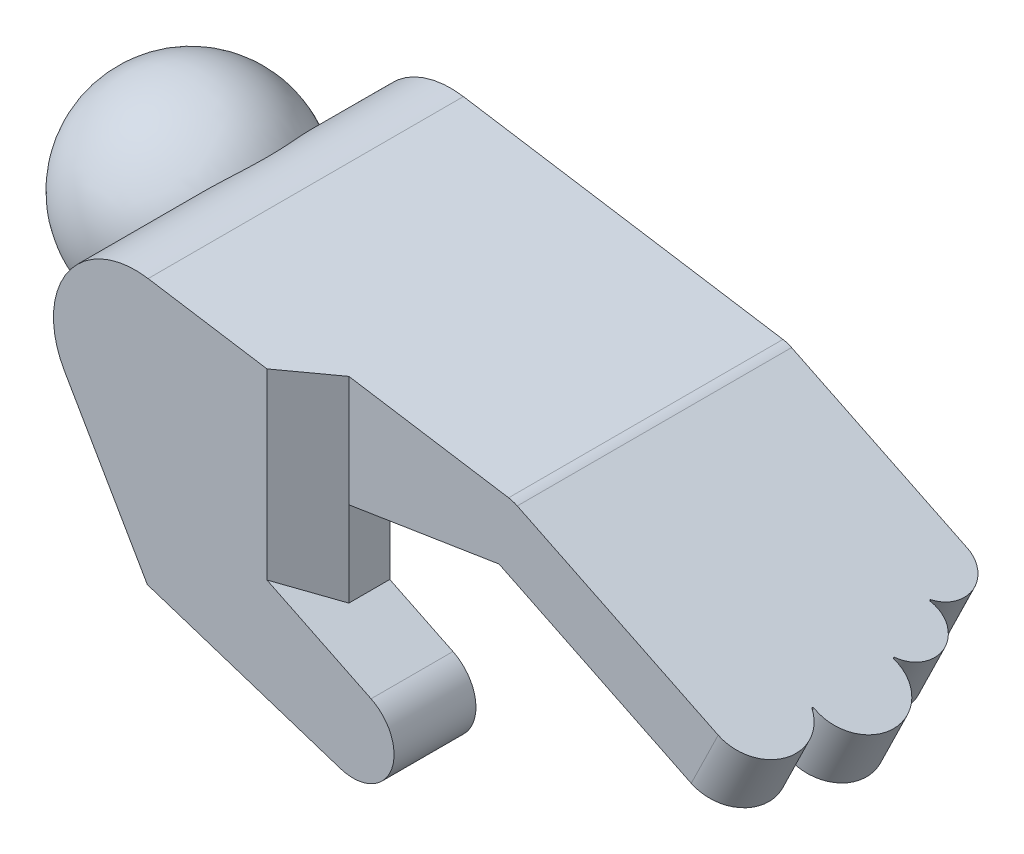
ISO-10303-21;
HEADER;
FILE_DESCRIPTION(('STEP AP214'),'2;1');
FILE_NAME('part.step','',(''),(''),'','','');
FILE_SCHEMA(('AUTOMOTIVE_DESIGN { 1 0 10303 214 1 1 1 1 }'));
ENDSEC;
DATA;
#1=APPLICATION_CONTEXT('core data for automotive mechanical design processes');
#2=APPLICATION_PROTOCOL_DEFINITION('international standard','automotive_design',2000,#1);
#3=PRODUCT_CONTEXT('',#1,'mechanical');
#4=PRODUCT('Part','Part','',(#3));
#5=PRODUCT_RELATED_PRODUCT_CATEGORY('part','',(#4));
#6=PRODUCT_DEFINITION_FORMATION('','',#4);
#7=PRODUCT_DEFINITION_CONTEXT('part definition',#1,'design');
#8=PRODUCT_DEFINITION('design','',#6,#7);
#9=PRODUCT_DEFINITION_SHAPE('','',#8);
#10=(LENGTH_UNIT() NAMED_UNIT(*) SI_UNIT(.MILLI.,.METRE.));
#11=(NAMED_UNIT(*) PLANE_ANGLE_UNIT() SI_UNIT($,.RADIAN.));
#12=(NAMED_UNIT(*) SI_UNIT($,.STERADIAN.) SOLID_ANGLE_UNIT());
#13=UNCERTAINTY_MEASURE_WITH_UNIT(LENGTH_MEASURE(1.E-05),#10,'distance_accuracy_value','');
#14=(GEOMETRIC_REPRESENTATION_CONTEXT(3) GLOBAL_UNCERTAINTY_ASSIGNED_CONTEXT((#13)) GLOBAL_UNIT_ASSIGNED_CONTEXT((#10,
#11,#12)) REPRESENTATION_CONTEXT('',''));
#15=CARTESIAN_POINT('',(0.,0.,0.));
#16=DIRECTION('',(0.,0.,1.));
#17=DIRECTION('',(1.,0.,0.));
#18=AXIS2_PLACEMENT_3D('',#15,#16,#17);
#19=CARTESIAN_POINT('',(0.,0.,313.765538695854));
#20=DIRECTION('',(0.,0.,1.));
#21=DIRECTION('',(-1.,0.,0.));
#22=AXIS2_PLACEMENT_3D('',#19,#20,#21);
#23=CYLINDRICAL_SURFACE('',#22,25.4);
#24=CARTESIAN_POINT('',(-14.2875000000001,21.0006510315752,356.310538695854));
#25=CARTESIAN_POINT('',(-14.2874986942664,21.0006504840851,355.865316795389));
#26=CARTESIAN_POINT('',(-14.2953081922358,20.9953449296755,355.420112334765));
#27=CARTESIAN_POINT('',(-14.3264868198177,20.9740826371853,354.530467006661));
#28=CARTESIAN_POINT('',(-14.3498569674292,20.9581252022439,354.086026191047));
#29=CARTESIAN_POINT('',(-14.4120006937446,20.9154409688301,353.198656579094));
#30=CARTESIAN_POINT('',(-14.4507770141651,20.8887122534647,352.755728066047));
#31=CARTESIAN_POINT('',(-14.5434469305168,20.8242950444131,351.872244221875));
#32=CARTESIAN_POINT('',(-14.5973419405578,20.7866055255082,351.431689116675));
#33=CARTESIAN_POINT('',(-14.7813505313174,20.6565920938604,350.113490462707));
#34=CARTESIAN_POINT('',(-14.9337070642989,20.5473762862208,349.240445202628));
#35=CARTESIAN_POINT('',(-15.2933299297853,20.2811215383024,347.513356495106));
#36=CARTESIAN_POINT('',(-15.5005922793713,20.1240860667829,346.659311674222));
#37=CARTESIAN_POINT('',(-15.9644327536828,19.7581430548752,344.975107681859));
#38=CARTESIAN_POINT('',(-16.2210585055283,19.5491853612722,344.144972475631));
#39=CARTESIAN_POINT('',(-16.7762879292823,19.0748373220827,342.515257533565));
#40=CARTESIAN_POINT('',(-17.074896817441,18.8094399619717,341.715681610329));
#41=CARTESIAN_POINT('',(-17.7050993456686,18.2174673783565,340.154112624149));
#42=CARTESIAN_POINT('',(-18.0366554205532,17.8909614615965,339.392078208027));
#43=CARTESIAN_POINT('',(-18.72301395747,17.1713645796119,337.911247083232));
#44=CARTESIAN_POINT('',(-19.0778074919359,16.77829909486,337.192433970652));
#45=CARTESIAN_POINT('',(-19.698074177451,16.0408372382136,335.999570313704));
#46=CARTESIAN_POINT('',(-19.9607294175346,15.7136483536111,335.513358231345));
#47=CARTESIAN_POINT('',(-20.4873489903724,15.020582613139,334.570004724919));
#48=CARTESIAN_POINT('',(-20.751313205354,14.65470917974,334.112860734883));
#49=CARTESIAN_POINT('',(-21.2749618655439,13.8835494219702,333.231574544818));
#50=CARTESIAN_POINT('',(-21.5346511969972,13.4783123676138,332.807392255531));
#51=CARTESIAN_POINT('',(-22.0443412853831,12.627461213939,331.995190238018));
#52=CARTESIAN_POINT('',(-22.2943438885055,12.1818548631691,331.607163598898));
#53=CARTESIAN_POINT('',(-22.7308063467687,11.3423138017661,330.943881737589));
#54=CARTESIAN_POINT('',(-22.9200834161575,10.9554874876247,330.661467586093));
#55=CARTESIAN_POINT('',(-23.2850711723188,10.1566817400668,330.124915253476));
#56=CARTESIAN_POINT('',(-23.4607847356159,9.74470767331466,329.870771071838));
#57=CARTESIAN_POINT('',(-23.7952610731408,8.89680874924634,329.393100796652));
#58=CARTESIAN_POINT('',(-23.9540252529344,8.46088588248606,329.169572163806));
#59=CARTESIAN_POINT('',(-24.2512534757125,7.56693688587108,328.75548637586));
#60=CARTESIAN_POINT('',(-24.3897171928589,7.10891040139303,328.564929749978));
#61=CARTESIAN_POINT('',(-24.6441297571777,6.16971403368265,328.217735436704));
#62=CARTESIAN_POINT('',(-24.7598936666471,5.68839091703919,328.06137525246));
#63=CARTESIAN_POINT('',(-24.964603377329,4.70941624230395,327.786615649843));
#64=CARTESIAN_POINT('',(-25.0535487892989,4.21176444733459,327.668216782437));
#65=CARTESIAN_POINT('',(-25.202164653844,3.20465425990389,327.471205024985));
#66=CARTESIAN_POINT('',(-25.2618533468752,2.69520343173523,327.392567344378));
#67=CARTESIAN_POINT('',(-25.3503347241816,1.66901685292015,327.276223965057));
#68=CARTESIAN_POINT('',(-25.3791317155348,1.15228212801267,327.238512560185));
#69=CARTESIAN_POINT('',(-25.4033365174727,0.183902258199855,327.206812286342));
#70=CARTESIAN_POINT('',(-25.4025903098686,-0.267492897680755,327.207787210874));
#71=CARTESIAN_POINT('',(-25.3771121944251,-1.16840876612933,327.241160585455));
#72=CARTESIAN_POINT('',(-25.3523827477915,-1.61792966628314,327.273555811093));
#73=CARTESIAN_POINT('',(-25.279490574644,-2.51164704994887,327.369357636389));
#74=CARTESIAN_POINT('',(-25.2313313649835,-2.95584432229798,327.432759581885));
#75=CARTESIAN_POINT('',(-25.1126199815714,-3.83580958646496,327.58980927665));
#76=CARTESIAN_POINT('',(-25.0420673950719,-4.2715774227569,327.683457583412));
#77=CARTESIAN_POINT('',(-24.8822465753655,-5.12006857663343,327.896972379774));
#78=CARTESIAN_POINT('',(-24.7935407591993,-5.53309627168716,328.016054848127));
#79=CARTESIAN_POINT('',(-24.5979903249191,-6.34615695257178,328.280610986714));
#80=CARTESIAN_POINT('',(-24.4911463087951,-6.74619036914593,328.42608378109));
#81=CARTESIAN_POINT('',(-24.2611922024166,-7.53139660098538,328.742073136512));
#82=CARTESIAN_POINT('',(-24.1380815889216,-7.91656893770576,328.912590503176));
#83=CARTESIAN_POINT('',(-23.8776053229466,-8.67058905862418,329.277239563222));
#84=CARTESIAN_POINT('',(-23.7402378123341,-9.03943470597027,329.47137433528));
#85=CARTESIAN_POINT('',(-23.4382445568037,-9.79756248541901,329.903377581798));
#86=CARTESIAN_POINT('',(-23.2722715653822,-10.1849101485111,330.143698463196));
#87=CARTESIAN_POINT('',(-22.9283245879777,-10.9372326187328,330.649385973208));
#88=CARTESIAN_POINT('',(-22.7503501265942,-11.3022065385024,330.914753594137));
#89=CARTESIAN_POINT('',(-22.3850891575176,-12.009424049734,331.468778603957));
#90=CARTESIAN_POINT('',(-22.1977975852448,-12.3516550372519,331.757448713851));
#91=CARTESIAN_POINT('',(-21.8166665848664,-13.0130240232139,332.356161834644));
#92=CARTESIAN_POINT('',(-21.6228259741793,-13.3321578178764,332.66620871625));
#93=CARTESIAN_POINT('',(-21.1336062810805,-14.1006775780671,333.465348345097));
#94=CARTESIAN_POINT('',(-20.8357310304868,-14.5357893412474,333.966717682813));
#95=CARTESIAN_POINT('',(-20.2390038816648,-15.3557839209573,335.008516828909));
#96=CARTESIAN_POINT('',(-19.9401516449805,-15.7406468866985,335.548961943962));
#97=CARTESIAN_POINT('',(-19.3483285713351,-16.4626964595997,336.665007342711));
#98=CARTESIAN_POINT('',(-19.0553662922109,-16.7998174686624,337.240654469912));
#99=CARTESIAN_POINT('',(-18.4822534895632,-17.428344928899,338.422294522743));
#100=CARTESIAN_POINT('',(-18.2021018325466,-17.7197554301378,339.028284753615));
#101=CARTESIAN_POINT('',(-17.655538560178,-18.2645421536684,340.278013398218));
#102=CARTESIAN_POINT('',(-17.3894597033053,-18.5171502143908,340.922231333266));
#103=CARTESIAN_POINT('',(-16.8819412450539,-18.9809974338255,342.234774640221));
#104=CARTESIAN_POINT('',(-16.6405018685819,-19.1922362149396,342.903100232105));
#105=CARTESIAN_POINT('',(-16.1870864732721,-19.5761715888971,344.260277668861));
#106=CARTESIAN_POINT('',(-15.9751029506536,-19.748878004547,344.949124231582));
#107=CARTESIAN_POINT('',(-15.5846354049784,-20.0584443736291,346.344174901933));
#108=CARTESIAN_POINT('',(-15.4061540631932,-20.1953014582874,347.050380393735));
#109=CARTESIAN_POINT('',(-15.0571409775409,-20.4572391343229,348.606241057494));
#110=CARTESIAN_POINT('',(-14.893927079856,-20.5756777838909,349.458675460193));
#111=CARTESIAN_POINT('',(-14.623601226045,-20.7686751885555,351.177356506154));
#112=CARTESIAN_POINT('',(-14.5164949153441,-20.8432295282001,352.043604530281));
#113=CARTESIAN_POINT('',(-14.3613252214602,-20.9504482731531,353.784109273622));
#114=CARTESIAN_POINT('',(-14.313271671088,-20.9831057022924,354.658367302163));
#115=CARTESIAN_POINT('',(-14.2775752024917,-21.0074107874627,356.408662553159));
#116=CARTESIAN_POINT('',(-14.2899310179491,-20.9990593031344,357.284699737934));
#117=CARTESIAN_POINT('',(-14.3753479695872,-20.9406805821822,359.045648368404));
#118=CARTESIAN_POINT('',(-14.449319483423,-20.8900283183938,359.930495074302));
#119=CARTESIAN_POINT('',(-14.6570509388758,-20.7448032633027,361.689518496986));
#120=CARTESIAN_POINT('',(-14.7908128513621,-20.6502290241973,362.563694861069));
#121=CARTESIAN_POINT('',(-15.1144931659491,-20.4145085488666,364.296014406867));
#122=CARTESIAN_POINT('',(-15.3044607078546,-20.2733215471804,365.154142857186));
#123=CARTESIAN_POINT('',(-15.7351836903612,-19.9408609717466,366.847641600645));
#124=CARTESIAN_POINT('',(-15.9759382526866,-19.7495882641329,367.683012287059));
#125=CARTESIAN_POINT('',(-16.5029832525491,-19.3113853670171,369.329819021072));
#126=CARTESIAN_POINT('',(-16.7895217254826,-19.0641487636749,370.141094383013));
#127=CARTESIAN_POINT('',(-17.3989974589035,-18.5095808350739,371.728920148909));
#128=CARTESIAN_POINT('',(-17.7219398091186,-18.2022411022038,372.505465675937));
#129=CARTESIAN_POINT('',(-18.3940944779415,-17.5227091131552,374.01625516464));
#130=CARTESIAN_POINT('',(-18.7432676229845,-17.1506125133526,374.750559424045));
#131=CARTESIAN_POINT('',(-19.457196742374,-16.3361687985509,376.170919657132));
#132=CARTESIAN_POINT('',(-19.8219449912997,-15.8938562222403,376.856999114067));
#133=CARTESIAN_POINT('',(-20.436376464989,-15.0891288542456,377.961029719017));
#134=CARTESIAN_POINT('',(-20.6852896043994,-14.7468519300986,378.394179145816));
#135=CARTESIAN_POINT('',(-21.1800880698568,-14.0269234948975,379.231937492493));
#136=CARTESIAN_POINT('',(-21.4259737436976,-13.649276090907,379.636549716442));
#137=CARTESIAN_POINT('',(-21.9096759813927,-12.8584862291662,380.413664481274));
#138=CARTESIAN_POINT('',(-22.1475016927434,-12.4453860275078,380.786204216408));
#139=CARTESIAN_POINT('',(-22.6102745449212,-11.5833772847153,381.496277692584));
#140=CARTESIAN_POINT('',(-22.8352237511424,-11.1344745141227,381.833817054781));
#141=CARTESIAN_POINT('',(-23.2283719835899,-10.2849914243429,382.413466745548));
#142=CARTESIAN_POINT('',(-23.3995385318585,-9.89006479986961,382.661861713311));
#143=CARTESIAN_POINT('',(-23.7264812663222,-9.07775684684525,383.130405408156));
#144=CARTESIAN_POINT('',(-23.8822605045342,-8.66037999668382,383.350559739262));
#145=CARTESIAN_POINT('',(-24.1753982658378,-7.80477817202381,383.760491010836));
#146=CARTESIAN_POINT('',(-24.3127591392672,-7.36655586726713,383.950271827818));
#147=CARTESIAN_POINT('',(-24.5661721357114,-6.4714381136612,384.297410047068));
#148=CARTESIAN_POINT('',(-24.6822239483945,-6.01454239298258,384.454766977138));
#149=CARTESIAN_POINT('',(-24.891045116151,-5.08189863963257,384.736056805149));
#150=CARTESIAN_POINT('',(-24.9836555781958,-4.6060459944122,384.85976200166));
#151=CARTESIAN_POINT('',(-25.1422934569433,-3.64193759713006,385.070691874088));
#152=CARTESIAN_POINT('',(-25.208320586449,-3.15368171112862,385.15791615588));
#153=CARTESIAN_POINT('',(-25.3120469887455,-2.16914273854084,385.294588837504));
#154=CARTESIAN_POINT('',(-25.3497587696533,-1.67286329539577,385.344053917373));
#155=CARTESIAN_POINT('',(-25.395880116372,-0.676633260395488,385.404515819456));
#156=CARTESIAN_POINT('',(-25.4042927659408,-0.17668306044138,385.415516690059));
#157=CARTESIAN_POINT('',(-25.3923157033826,0.766304832102038,385.399831436847));
#158=CARTESIAN_POINT('',(-25.3750400497521,1.20945816685981,385.377220046905));
#159=CARTESIAN_POINT('',(-25.3175888579372,2.0916589826863,385.301816709053));
#160=CARTESIAN_POINT('',(-25.2774153583744,2.53070682573526,385.249027447912));
#161=CARTESIAN_POINT('',(-25.175019659029,3.4015609371651,385.113898690222));
#162=CARTESIAN_POINT('',(-25.1127994210798,3.83336784630241,385.031561822964));
#163=CARTESIAN_POINT('',(-24.9675772230404,4.68695346128789,384.83826577854));
#164=CARTESIAN_POINT('',(-24.8845746263919,5.10873185953196,384.72730572465));
#165=CARTESIAN_POINT('',(-24.6995938082607,5.93890324025257,384.478197700843));
#166=CARTESIAN_POINT('',(-24.5976546363742,6.347321770019,384.340105647313));
#167=CARTESIAN_POINT('',(-24.376557721504,7.14958616940361,384.037944073852));
#168=CARTESIAN_POINT('',(-24.2574002237255,7.5434322464469,383.873874923856));
#169=CARTESIAN_POINT('',(-24.0038934966984,8.31492606818439,383.521203261934));
#170=CARTESIAN_POINT('',(-23.8695429343697,8.69257238745234,383.332598596978));
#171=CARTESIAN_POINT('',(-23.5877809959132,9.43040764869779,382.932361642552));
#172=CARTESIAN_POINT('',(-23.4403678470097,9.79059421084866,382.720726226595));
#173=CARTESIAN_POINT('',(-23.1157715918167,10.5359429477581,382.24847816587));
#174=CARTESIAN_POINT('',(-22.937160267212,10.9186960590394,381.985044744265));
#175=CARTESIAN_POINT('',(-22.5692452788229,11.6602112282317,381.433140884211));
#176=CARTESIAN_POINT('',(-22.3799410682891,12.0189720573157,381.144669165095));
#177=CARTESIAN_POINT('',(-21.9934803227064,12.7123739254043,380.544518237521));
#178=CARTESIAN_POINT('',(-21.7963195853909,13.0470017799465,380.232826529605));
#179=CARTESIAN_POINT('',(-21.3970326149972,13.6920020480467,379.588217762124));
#180=CARTESIAN_POINT('',(-21.1949054876361,14.0023700505087,379.255296862409));
#181=CARTESIAN_POINT('',(-20.6843714396607,14.7517642406281,378.394685829813));
#182=CARTESIAN_POINT('',(-20.3744622422452,15.1754402942078,377.854440510162));
#183=CARTESIAN_POINT('',(-19.7577641712185,15.9700955542904,376.734735546271));
#184=CARTESIAN_POINT('',(-19.4509766028516,16.3410534957322,376.155260216067));
#185=CARTESIAN_POINT('',(-18.8476413750872,17.0334256985636,374.961003635132));
#186=CARTESIAN_POINT('',(-18.551110662881,17.3547607446052,374.346168040867));
#187=CARTESIAN_POINT('',(-17.9755771371756,17.9502116863526,373.086361787599));
#188=CARTESIAN_POINT('',(-17.6965724887381,18.2243325305282,372.441394295705));
#189=CARTESIAN_POINT('',(-17.1574124395316,18.7329370633162,371.113765122468));
#190=CARTESIAN_POINT('',(-16.8976653476613,18.9666552048906,370.430645059642));
#191=CARTESIAN_POINT('',(-16.4079806079214,19.3918373031753,369.040952692818));
#192=CARTESIAN_POINT('',(-16.1780448431024,19.5832985912416,368.334378910889));
#193=CARTESIAN_POINT('',(-15.7530639248419,19.9267544702823,366.90242258853));
#194=CARTESIAN_POINT('',(-15.5579771222208,20.0787962723092,366.177063702696));
#195=CARTESIAN_POINT('',(-15.2064216883631,20.3463415235515,364.71049607774));
#196=CARTESIAN_POINT('',(-15.0499477829224,20.4618499635316,363.969289518324));
#197=CARTESIAN_POINT('',(-14.8116059079041,20.6347355531499,362.655473703952));
#198=CARTESIAN_POINT('',(-14.7208466792511,20.6994150797694,362.085408257238));
#199=CARTESIAN_POINT('',(-14.5644656215408,20.809746359997,360.940071793075));
#200=CARTESIAN_POINT('',(-14.4988402141455,20.8554008223124,360.36480152859));
#201=CARTESIAN_POINT('',(-14.3935012062784,20.9282396035887,359.210614976644));
#202=CARTESIAN_POINT('',(-14.3537931079562,20.955420000624,358.631697941306));
#203=CARTESIAN_POINT('',(-14.3007922663057,20.9916268208374,357.47202371082));
#204=CARTESIAN_POINT('',(-14.287501703141,21.000651745697,356.891266367756));
#205=CARTESIAN_POINT('',(-14.2875000000001,21.0006510315752,356.310538695854));
#206=B_SPLINE_CURVE_WITH_KNOTS('',3,(#24,#25,#26,#27,#28,#29,#30,#31,#32,#33,#34,#35,#36,#37,
#38,#39,#40,#41,#42,#43,#44,#45,#46,#47,#48,#49,#50,#51,#52,#53,#54,#55,#56,#57,#58,#59,#60,#61,
#62,#63,#64,#65,#66,#67,#68,#69,#70,#71,#72,#73,#74,#75,#76,#77,#78,#79,#80,#81,#82,#83,#84,#85,
#86,#87,#88,#89,#90,#91,#92,#93,#94,#95,#96,#97,#98,#99,#100,#101,#102,#103,#104,#105,#106,#107,
#108,#109,#110,#111,#112,#113,#114,#115,#116,#117,#118,#119,#120,#121,#122,#123,#124,#125,#126,
#127,#128,#129,#130,#131,#132,#133,#134,#135,#136,#137,#138,#139,#140,#141,#142,#143,#144,#145,
#146,#147,#148,#149,#150,#151,#152,#153,#154,#155,#156,#157,#158,#159,#160,#161,#162,#163,#164,
#165,#166,#167,#168,#169,#170,#171,#172,#173,#174,#175,#176,#177,#178,#179,#180,#181,#182,#183,
#184,#185,#186,#187,#188,#189,#190,#191,#192,#193,#194,#195,#196,#197,#198,#199,#200,#201,#202,
#203,#204,#205),.UNSPECIFIED.,.T.,.F.,(4,2,2,2,2,2,2,2,2,2,2,2,2,2,2,2,2,2,2,2,2,2,2,2,2,2,2,2,
2,2,2,2,2,2,2,2,2,2,2,2,2,2,2,2,2,2,2,2,2,2,2,2,2,2,2,2,2,2,2,2,2,2,2,2,2,2,2,2,2,2,2,2,2,2,2,2,
2,2,2,2,2,2,2,2,2,2,2,2,2,2,4),(0.,1.33553453870048,2.67115645849025,4.00701617506121,
5.34300088146888,8.01836659782021,10.6935382937792,13.3713041313765,16.0494029660292,
18.7244826207466,21.3985405015369,23.3235736274041,25.248436585455,27.1709205686333,
29.0930363257601,30.6365856970336,32.1798068105105,33.7228998493409,35.2660176532956,
36.8212278977692,38.3764607134181,39.9307226630667,41.4847678814431,42.8372635889265,
44.1896205154006,45.5417745130463,46.8939534346378,48.2092839245379,49.5245707683714,
50.8398999307591,52.1554007386584,53.6093464692773,55.0633498272502,56.5181523753357,
57.9732190409082,60.1528571378662,62.3333537121839,64.5168178386655,66.7000883953736,
68.9221679816625,71.1442678490391,73.3658006019902,75.5875110745736,78.2123219991517,
80.837396975877,83.4629089917732,86.088365971166,88.7533169834432,91.4183558468972,
94.085731636974,96.7530613030669,99.4353644146858,102.118043012817,104.796791984184,
107.474227359658,109.28947345652,111.104509035735,112.917410550587,114.730020456094,
116.219465223251,117.708613968728,119.19757250513,120.686552724063,122.185370628423,
123.68420472505,125.182376331514,126.680390249409,128.010975946393,129.341443198292,
130.671792088013,132.002181730965,133.329857799361,134.657514962266,135.98528870788,
137.313242927768,138.805197338486,140.297228105088,141.790067926469,143.283178558039,
145.539671353279,147.797071788767,150.058039374249,152.318769845749,154.61850887813,
156.918393104233,159.21550999766,161.512312949924,163.254059611024,164.995558204898,
166.73742639238,168.479438325291),.UNSPECIFIED.);
#207=CARTESIAN_POINT('',(-14.2875000000001,21.0006510315752,356.310538695854));
#208=VERTEX_POINT('',#207);
#209=EDGE_CURVE('E20',#208,#208,#206,.T.);
#210=ORIENTED_EDGE('',*,*,#209,.F.);
#211=EDGE_LOOP('',(#210));
#212=FACE_BOUND('',#211,.T.);
#213=CARTESIAN_POINT('',(0.,0.,386.155538695854));
#214=DIRECTION('',(0.,0.,-1.));
#215=DIRECTION('',(-1.,0.,0.));
#216=AXIS2_PLACEMENT_3D('',#213,#214,#215);
#217=CIRCLE('',#216,25.4);
#218=CARTESIAN_POINT('',(3.96874999999997,-25.0880254989806,386.155538695854));
#219=VERTEX_POINT('',#218);
#220=CARTESIAN_POINT('',(-21.9970452561249,-12.6999999999998,386.155538695854));
#221=VERTEX_POINT('',#220);
#222=EDGE_CURVE('E182',#219,#221,#217,.T.);
#223=ORIENTED_EDGE('',*,*,#222,.T.);
#224=DIRECTION('',(0.,0.,1.));
#225=VECTOR('',#224,1.);
#226=CARTESIAN_POINT('',(-21.9970452561249,-12.6999999999998,386.155538695854));
#227=LINE('',#226,#225);
#228=CARTESIAN_POINT('',(-21.9970452561249,-12.6999999999998,411.555538695854));
#229=VERTEX_POINT('',#228);
#230=EDGE_CURVE('E165',#221,#229,#227,.T.);
#231=ORIENTED_EDGE('',*,*,#230,.T.);
#232=CARTESIAN_POINT('',(0.,0.,411.555538695854));
#233=DIRECTION('',(0.,0.,-1.));
#234=DIRECTION('',(-1.,0.,0.));
#235=AXIS2_PLACEMENT_3D('',#232,#233,#234);
#236=CIRCLE('',#235,25.4);
#237=CARTESIAN_POINT('',(3.96874999999997,25.0880254989806,411.555538695854));
#238=VERTEX_POINT('',#237);
#239=EDGE_CURVE('E170',#229,#238,#236,.T.);
#240=ORIENTED_EDGE('',*,*,#239,.T.);
#241=DIRECTION('',(0.,0.,1.));
#242=VECTOR('',#241,1.);
#243=CARTESIAN_POINT('',(3.96874999999997,25.0880254989806,313.765538695854));
#244=LINE('',#243,#242);
#245=CARTESIAN_POINT('',(3.96874999999997,25.0880254989806,313.765538695854));
#246=VERTEX_POINT('',#245);
#247=EDGE_CURVE('E288',#246,#238,#244,.T.);
#248=ORIENTED_EDGE('',*,*,#247,.F.);
#249=CARTESIAN_POINT('',(0.,0.,313.765538695854));
#250=DIRECTION('',(0.,0.,1.));
#251=DIRECTION('',(1.,0.,0.));
#252=AXIS2_PLACEMENT_3D('',#249,#250,#251);
#253=CIRCLE('',#252,25.4);
#254=CARTESIAN_POINT('',(3.96874999999997,-25.0880254989806,313.765538695854));
#255=VERTEX_POINT('',#254);
#256=EDGE_CURVE('E271',#246,#255,#253,.T.);
#257=ORIENTED_EDGE('',*,*,#256,.T.);
#258=DIRECTION('',(0.,0.,1.));
#259=VECTOR('',#258,1.);
#260=CARTESIAN_POINT('',(3.96874999999997,-25.0880254989806,313.765538695854));
#261=LINE('',#260,#259);
#262=EDGE_CURVE('E274',#255,#219,#261,.T.);
#263=ORIENTED_EDGE('',*,*,#262,.T.);
#264=EDGE_LOOP('',(#223,#231,#240,#248,#257,#263));
#265=FACE_BOUND('',#264,.T.);
#266=ADVANCED_FACE('F16',(#212,#265),#23,.T.);
#267=CARTESIAN_POINT('',(176.861881251003,-47.3235725570232,313.765538695854));
#268=DIRECTION('',(0.438538999410141,0.898712159702067,0.));
#269=DIRECTION('',(-0.898712159702067,0.438538999410141,0.));
#270=AXIS2_PLACEMENT_3D('',#267,#268,#269);
#271=PLANE('',#270);
#272=CARTESIAN_POINT('',(159.741414608679,-38.9694046182601,386.155538695854));
#273=DIRECTION('',(-0.438538999410141,-0.898712159702067,0.));
#274=DIRECTION('',(-0.898712159702067,0.438538999410141,0.));
#275=AXIS2_PLACEMENT_3D('',#272,#273,#274);
#276=CIRCLE('',#275,12.7);
#277=CARTESIAN_POINT('',(164.716588696425,-41.3971094654435,374.725582791671));
#278=VERTEX_POINT('',#277);
#279=CARTESIAN_POINT('',(159.741414608679,-38.9694046182601,398.855538695854));
#280=VERTEX_POINT('',#279);
#281=EDGE_CURVE('E226',#278,#280,#276,.T.);
#282=ORIENTED_EDGE('',*,*,#281,.T.);
#283=DIRECTION('',(0.898712159702067,-0.43853899941014,0.));
#284=VECTOR('',#283,1.);
#285=CARTESIAN_POINT('',(176.861881251003,-47.3235725570232,398.855538695854));
#286=LINE('',#285,#284);
#287=CARTESIAN_POINT('',(100.121947229302,-9.87726283775403,398.855538695854));
#288=VERTEX_POINT('',#287);
#289=EDGE_CURVE('E276',#288,#280,#286,.T.);
#290=ORIENTED_EDGE('',*,*,#289,.F.);
#291=DIRECTION('',(0.,0.,1.));
#292=VECTOR('',#291,1.);
#293=CARTESIAN_POINT('',(100.121947229302,-9.87726283775403,313.765538695854));
#294=LINE('',#293,#292);
#295=CARTESIAN_POINT('',(100.121947229302,-9.87726283775403,313.765538695854));
#296=VERTEX_POINT('',#295);
#297=EDGE_CURVE('E295',#296,#288,#294,.T.);
#298=ORIENTED_EDGE('',*,*,#297,.F.);
#299=DIRECTION('',(0.898712159702067,-0.43853899941014,0.));
#300=VECTOR('',#299,1.);
#301=CARTESIAN_POINT('',(176.861881251003,-47.3235725570232,313.765538695854));
#302=LINE('',#301,#300);
#303=CARTESIAN_POINT('',(151.967710773275,-35.1761185645596,313.765538695854));
#304=VERTEX_POINT('',#303);
#305=EDGE_CURVE('E259',#296,#304,#302,.T.);
#306=ORIENTED_EDGE('',*,*,#305,.T.);
#307=CARTESIAN_POINT('',(151.967710773275,-35.1761185645596,323.290538695854));
#308=DIRECTION('',(-0.438538999410141,-0.898712159702067,0.));
#309=DIRECTION('',(-0.898712159702067,0.438538999410141,0.));
#310=AXIS2_PLACEMENT_3D('',#307,#308,#309);
#311=CIRCLE('',#310,9.525);
#312=CARTESIAN_POINT('',(157.480618119654,-37.8662177753273,330.577296810851));
#313=VERTEX_POINT('',#312);
#314=EDGE_CURVE('E238',#304,#313,#311,.T.);
#315=ORIENTED_EDGE('',*,*,#314,.T.);
#316=CARTESIAN_POINT('',(157.627628982224,-37.9379537542812,330.771610360584));
#317=DIRECTION('',(-0.438538999410141,-0.898712159702067,0.));
#318=DIRECTION('',(-0.898712159702067,0.438538999410141,0.));
#319=AXIS2_PLACEMENT_3D('',#316,#317,#318);
#320=CIRCLE('',#319,0.254000000000007);
#321=CARTESIAN_POINT('',(157.682532504989,-37.964744685813,331.018154168406));
#322=VERTEX_POINT('',#321);
#323=EDGE_CURVE('E241',#313,#322,#320,.F.);
#324=ORIENTED_EDGE('',*,*,#323,.T.);
#325=CARTESIAN_POINT('',(159.741414608679,-38.9694046182601,340.263546961752));
#326=DIRECTION('',(-0.438538999410141,-0.898712159702067,0.));
#327=DIRECTION('',(-0.898712159702067,0.438538999410141,0.));
#328=AXIS2_PLACEMENT_3D('',#325,#326,#327);
#329=CIRCLE('',#328,9.525);
#330=CARTESIAN_POINT('',(164.098527906002,-41.0955181743046,348.462377967517));
#331=VERTEX_POINT('',#330);
#332=EDGE_CURVE('E244',#322,#331,#329,.T.);
#333=ORIENTED_EDGE('',*,*,#332,.T.);
#334=CARTESIAN_POINT('',(164.214717593931,-41.1522145357991,348.681013461004));
#335=DIRECTION('',(-0.438538999410141,-0.898712159702067,0.));
#336=DIRECTION('',(-0.898712159702067,0.438538999410141,0.));
#337=AXIS2_PLACEMENT_3D('',#334,#335,#336);
#338=CIRCLE('',#337,0.253999999999994);
#339=CARTESIAN_POINT('',(164.238904245477,-41.164016746166,348.933583676424));
#340=VERTEX_POINT('',#339);
#341=EDGE_CURVE('E247',#331,#340,#338,.F.);
#342=ORIENTED_EDGE('',*,*,#341,.T.);
#343=CARTESIAN_POINT('',(165.448236822787,-41.7541272645146,361.562094447437));
#344=DIRECTION('',(-0.438538999410141,-0.898712159702067,0.));
#345=DIRECTION('',(-0.898712159702067,0.438538999410141,0.));
#346=AXIS2_PLACEMENT_3D('',#343,#344,#345);
#347=CIRCLE('',#346,12.7);
#348=CARTESIAN_POINT('',(164.828487171212,-41.4517118702721,374.243358394643));
#349=VERTEX_POINT('',#348);
#350=EDGE_CURVE('E250',#340,#349,#347,.T.);
#351=ORIENTED_EDGE('',*,*,#350,.T.);
#352=CARTESIAN_POINT('',(164.81609217818,-41.4456635623872,374.496983673587));
#353=DIRECTION('',(-0.438538999410141,-0.898712159702067,0.));
#354=DIRECTION('',(-0.898712159702067,0.438538999410141,0.));
#355=AXIS2_PLACEMENT_3D('',#352,#353,#354);
#356=CIRCLE('',#355,0.254000000000002);
#357=EDGE_CURVE('E253',#349,#278,#356,.F.);
#358=ORIENTED_EDGE('',*,*,#357,.T.);
#359=EDGE_LOOP('',(#282,#290,#298,#306,#315,#324,#333,#342,#351,#358));
#360=FACE_BOUND('',#359,.T.);
#361=ADVANCED_FACE('F358',(#360),#271,.F.);
#362=CARTESIAN_POINT('',(105.777083969382,8.56023332116218,313.765538695854));
#363=DIRECTION('',(-0.43853899941014,-0.898712159702067,0.));
#364=DIRECTION('',(0.898712159702067,-0.43853899941014,0.));
#365=AXIS2_PLACEMENT_3D('',#362,#363,#364);
#366=PLANE('',#365);
#367=CARTESIAN_POINT('',(168.095582547442,-21.8489379759358,386.155538695854));
#368=DIRECTION('',(-0.43853899941014,-0.898712159702067,0.));
#369=DIRECTION('',(-0.898712159702067,0.43853899941014,0.));
#370=AXIS2_PLACEMENT_3D('',#367,#368,#369);
#371=CIRCLE('',#370,12.7);
#372=CARTESIAN_POINT('',(173.070756635188,-24.2766428231191,374.725582791671));
#373=VERTEX_POINT('',#372);
#374=CARTESIAN_POINT('',(168.095582547442,-21.8489379759358,398.855538695854));
#375=VERTEX_POINT('',#374);
#376=EDGE_CURVE('E220',#373,#375,#371,.T.);
#377=ORIENTED_EDGE('',*,*,#376,.F.);
#378=CARTESIAN_POINT('',(173.170260116943,-24.3251969200627,374.496983673587));
#379=DIRECTION('',(0.43853899941014,0.898712159702067,0.));
#380=DIRECTION('',(0.898712159702067,-0.43853899941014,0.));
#381=AXIS2_PLACEMENT_3D('',#378,#379,#380);
#382=CIRCLE('',#381,0.254000000000002);
#383=CARTESIAN_POINT('',(173.182655109975,-24.3312452279477,374.243358394643));
#384=VERTEX_POINT('',#383);
#385=EDGE_CURVE('E217',#384,#373,#382,.T.);
#386=ORIENTED_EDGE('',*,*,#385,.F.);
#387=CARTESIAN_POINT('',(173.80240476155,-24.6336606221901,361.562094447437));
#388=DIRECTION('',(-0.43853899941014,-0.898712159702067,0.));
#389=DIRECTION('',(-0.898712159702067,0.43853899941014,0.));
#390=AXIS2_PLACEMENT_3D('',#387,#388,#389);
#391=CIRCLE('',#390,12.7);
#392=CARTESIAN_POINT('',(172.59307218424,-24.0435501038417,348.933583676424));
#393=VERTEX_POINT('',#392);
#394=EDGE_CURVE('E214',#393,#384,#391,.T.);
#395=ORIENTED_EDGE('',*,*,#394,.F.);
#396=CARTESIAN_POINT('',(172.568885532694,-24.0317478934747,348.681013461004));
#397=DIRECTION('',(0.43853899941014,0.898712159702067,0.));
#398=DIRECTION('',(0.898712159702067,-0.43853899941014,0.));
#399=AXIS2_PLACEMENT_3D('',#396,#397,#398);
#400=CIRCLE('',#399,0.253999999999994);
#401=CARTESIAN_POINT('',(172.452695844765,-23.9750515319802,348.462377967517));
#402=VERTEX_POINT('',#401);
#403=EDGE_CURVE('E211',#402,#393,#400,.T.);
#404=ORIENTED_EDGE('',*,*,#403,.F.);
#405=CARTESIAN_POINT('',(168.095582547442,-21.8489379759358,340.263546961752));
#406=DIRECTION('',(-0.43853899941014,-0.898712159702067,0.));
#407=DIRECTION('',(-0.898712159702067,0.43853899941014,0.));
#408=AXIS2_PLACEMENT_3D('',#405,#406,#407);
#409=CIRCLE('',#408,9.525);
#410=CARTESIAN_POINT('',(166.036700443752,-20.8442780434887,331.018154168406));
#411=VERTEX_POINT('',#410);
#412=EDGE_CURVE('E208',#411,#402,#409,.T.);
#413=ORIENTED_EDGE('',*,*,#412,.F.);
#414=CARTESIAN_POINT('',(165.981796920987,-20.8174871119567,330.771610360584));
#415=DIRECTION('',(0.43853899941014,0.898712159702067,0.));
#416=DIRECTION('',(-0.898712159702067,0.43853899941014,0.));
#417=AXIS2_PLACEMENT_3D('',#414,#415,#416);
#418=CIRCLE('',#417,0.254000000000007);
#419=CARTESIAN_POINT('',(165.834786058417,-20.7457511330029,330.577296810851));
#420=VERTEX_POINT('',#419);
#421=EDGE_CURVE('E205',#420,#411,#418,.T.);
#422=ORIENTED_EDGE('',*,*,#421,.F.);
#423=CARTESIAN_POINT('',(160.321878712038,-18.0556519222351,323.290538695854));
#424=DIRECTION('',(-0.43853899941014,-0.898712159702067,0.));
#425=DIRECTION('',(-0.898712159702067,0.43853899941014,0.));
#426=AXIS2_PLACEMENT_3D('',#423,#424,#425);
#427=CIRCLE('',#426,9.525);
#428=CARTESIAN_POINT('',(160.321878712038,-18.0556519222351,313.765538695854));
#429=VERTEX_POINT('',#428);
#430=EDGE_CURVE('E202',#429,#420,#427,.T.);
#431=ORIENTED_EDGE('',*,*,#430,.F.);
#432=DIRECTION('',(-0.898712159702067,0.43853899941014,0.));
#433=VECTOR('',#432,1.);
#434=CARTESIAN_POINT('',(105.777083969382,8.56023332116218,313.765538695854));
#435=LINE('',#434,#433);
#436=CARTESIAN_POINT('',(105.777083969382,8.56023332116218,313.765538695854));
#437=VERTEX_POINT('',#436);
#438=EDGE_CURVE('E263',#429,#437,#435,.T.);
#439=ORIENTED_EDGE('',*,*,#438,.T.);
#440=DIRECTION('',(0.,0.,1.));
#441=VECTOR('',#440,1.);
#442=CARTESIAN_POINT('',(105.777083969382,8.56023332116218,313.765538695854));
#443=LINE('',#442,#441);
#444=CARTESIAN_POINT('',(105.777083969382,8.56023332116218,398.855538695854));
#445=VERTEX_POINT('',#444);
#446=EDGE_CURVE('E292',#437,#445,#443,.T.);
#447=ORIENTED_EDGE('',*,*,#446,.T.);
#448=DIRECTION('',(-0.898712159702067,0.43853899941014,0.));
#449=VECTOR('',#448,1.);
#450=CARTESIAN_POINT('',(105.777083969382,8.56023332116218,398.855538695854));
#451=LINE('',#450,#449);
#452=EDGE_CURVE('E279',#375,#445,#451,.T.);
#453=ORIENTED_EDGE('',*,*,#452,.F.);
#454=EDGE_LOOP('',(#377,#386,#395,#404,#413,#422,#431,#439,#447,#453));
#455=FACE_BOUND('',#454,.T.);
#456=ADVANCED_FACE('F364',(#455),#366,.F.);
#457=CARTESIAN_POINT('',(0.,0.,313.765538695854));
#458=DIRECTION('',(0.,0.,-1.));
#459=DIRECTION('',(1.,0.,0.));
#460=AXIS2_PLACEMENT_3D('',#457,#458,#459);
#461=PLANE('',#460);
#462=ORIENTED_EDGE('',*,*,#305,.F.);
#463=DIRECTION('',(0.987717539329944,0.15625,0.));
#464=VECTOR('',#463,1.);
#465=CARTESIAN_POINT('',(100.121947229302,-9.87726283775403,313.765538695854));
#466=LINE('',#465,#464);
#467=EDGE_CURVE('E257',#255,#296,#466,.T.);
#468=ORIENTED_EDGE('',*,*,#467,.F.);
#469=ORIENTED_EDGE('',*,*,#256,.F.);
#470=DIRECTION('',(-0.987717539329945,0.15625,0.));
#471=VECTOR('',#470,1.);
#472=CARTESIAN_POINT('',(3.96874999999997,25.0880254989806,313.765538695854));
#473=LINE('',#472,#471);
#474=CARTESIAN_POINT('',(103.08828125,9.40800956211774,313.765538695854));
#475=VERTEX_POINT('',#474);
#476=EDGE_CURVE('E269',#475,#246,#473,.T.);
#477=ORIENTED_EDGE('',*,*,#476,.F.);
#478=CARTESIAN_POINT('',(101.6,0.,313.765538695854));
#479=DIRECTION('',(0.,0.,1.));
#480=DIRECTION('',(1.,0.,0.));
#481=AXIS2_PLACEMENT_3D('',#478,#479,#480);
#482=CIRCLE('',#481,9.525);
#483=EDGE_CURVE('E266',#437,#475,#482,.T.);
#484=ORIENTED_EDGE('',*,*,#483,.F.);
#485=ORIENTED_EDGE('',*,*,#438,.F.);
#486=DIRECTION('',(0.43853899941014,0.898712159702067,0.));
#487=VECTOR('',#486,1.);
#488=CARTESIAN_POINT('',(115.766316371968,-109.364807347965,313.765538695854));
#489=LINE('',#488,#487);
#490=EDGE_CURVE('E300',#304,#429,#489,.T.);
#491=ORIENTED_EDGE('',*,*,#490,.F.);
#492=EDGE_LOOP('',(#462,#468,#469,#477,#484,#485,#491));
#493=FACE_BOUND('',#492,.T.);
#494=ADVANCED_FACE('F393',(#493),#461,.T.);
#495=CARTESIAN_POINT('',(0.,0.,398.855538695854));
#496=DIRECTION('',(0.,0.,-1.));
#497=DIRECTION('',(1.,0.,0.));
#498=AXIS2_PLACEMENT_3D('',#495,#496,#497);
#499=PLANE('',#498);
#500=DIRECTION('',(0.987717539329944,0.15625,0.));
#501=VECTOR('',#500,1.);
#502=CARTESIAN_POINT('',(100.121947229302,-9.87726283775403,398.855538695854));
#503=LINE('',#502,#501);
#504=CARTESIAN_POINT('',(53.528515625,-17.2480175305492,398.855538695854));
#505=VERTEX_POINT('',#504);
#506=EDGE_CURVE('E256',#505,#288,#503,.T.);
#507=ORIENTED_EDGE('',*,*,#506,.T.);
#508=ORIENTED_EDGE('',*,*,#289,.T.);
#509=DIRECTION('',(0.43853899941014,0.898712159702067,0.));
#510=VECTOR('',#509,1.);
#511=CARTESIAN_POINT('',(123.540020207372,-113.158093401666,398.855538695854));
#512=LINE('',#511,#510);
#513=EDGE_CURVE('E298',#280,#375,#512,.T.);
#514=ORIENTED_EDGE('',*,*,#513,.T.);
#515=ORIENTED_EDGE('',*,*,#452,.T.);
#516=CARTESIAN_POINT('',(101.6,0.,398.855538695854));
#517=DIRECTION('',(0.,0.,1.));
#518=DIRECTION('',(1.,0.,0.));
#519=AXIS2_PLACEMENT_3D('',#516,#517,#518);
#520=CIRCLE('',#519,9.525);
#521=CARTESIAN_POINT('',(103.08828125,9.40800956211774,398.855538695854));
#522=VERTEX_POINT('',#521);
#523=EDGE_CURVE('E282',#445,#522,#520,.T.);
#524=ORIENTED_EDGE('',*,*,#523,.T.);
#525=DIRECTION('',(-0.987717539329945,0.15625,0.));
#526=VECTOR('',#525,1.);
#527=CARTESIAN_POINT('',(3.96874999999991,25.0880254989806,398.855538695854));
#528=LINE('',#527,#526);
#529=CARTESIAN_POINT('',(53.528515625,17.2480175305492,398.855538695854));
#530=VERTEX_POINT('',#529);
#531=EDGE_CURVE('E260',#522,#530,#528,.T.);
#532=ORIENTED_EDGE('',*,*,#531,.T.);
#533=DIRECTION('',(0.,1.,0.));
#534=VECTOR('',#533,1.);
#535=CARTESIAN_POINT('',(53.528515625,0.,398.855538695854));
#536=LINE('',#535,#534);
#537=EDGE_CURVE('E199',#505,#530,#536,.T.);
#538=ORIENTED_EDGE('',*,*,#537,.F.);
#539=EDGE_LOOP('',(#507,#508,#514,#515,#524,#532,#538));
#540=FACE_BOUND('',#539,.T.);
#541=ADVANCED_FACE('F351',(#540),#499,.F.);
#542=CARTESIAN_POINT('',(100.121947229302,-9.87726283775403,313.765538695854));
#543=DIRECTION('',(-0.15625,0.987717539329944,0.));
#544=DIRECTION('',(-0.987717539329945,-0.15625,0.));
#545=AXIS2_PLACEMENT_3D('',#542,#543,#544);
#546=PLANE('',#545);
#547=DIRECTION('',(-0.987717539329945,-0.15625,0.));
#548=VECTOR('',#547,1.);
#549=CARTESIAN_POINT('',(100.121947229302,-9.87726283775403,386.155538695854));
#550=LINE('',#549,#548);
#551=CARTESIAN_POINT('',(53.5285156249999,-17.2480175305492,386.155538695854));
#552=VERTEX_POINT('',#551);
#553=EDGE_CURVE('E194',#552,#219,#550,.T.);
#554=ORIENTED_EDGE('',*,*,#553,.T.);
#555=ORIENTED_EDGE('',*,*,#262,.F.);
#556=ORIENTED_EDGE('',*,*,#467,.T.);
#557=ORIENTED_EDGE('',*,*,#297,.T.);
#558=ORIENTED_EDGE('',*,*,#506,.F.);
#559=DIRECTION('',(0.,0.,1.));
#560=VECTOR('',#559,1.);
#561=CARTESIAN_POINT('',(53.528515625,-17.2480175305492,313.765538695854));
#562=LINE('',#561,#560);
#563=EDGE_CURVE('E196',#552,#505,#562,.T.);
#564=ORIENTED_EDGE('',*,*,#563,.F.);
#565=EDGE_LOOP('',(#554,#555,#556,#557,#558,#564));
#566=FACE_BOUND('',#565,.T.);
#567=ADVANCED_FACE('F352',(#566),#546,.F.);
#568=CARTESIAN_POINT('',(101.6,0.,313.765538695854));
#569=DIRECTION('',(0.,0.,1.));
#570=DIRECTION('',(-1.,0.,0.));
#571=AXIS2_PLACEMENT_3D('',#568,#569,#570);
#572=CYLINDRICAL_SURFACE('',#571,9.525);
#573=ORIENTED_EDGE('',*,*,#523,.F.);
#574=ORIENTED_EDGE('',*,*,#446,.F.);
#575=ORIENTED_EDGE('',*,*,#483,.T.);
#576=DIRECTION('',(0.,0.,1.));
#577=VECTOR('',#576,1.);
#578=CARTESIAN_POINT('',(103.08828125,9.40800956211774,313.765538695854));
#579=LINE('',#578,#577);
#580=EDGE_CURVE('E290',#475,#522,#579,.T.);
#581=ORIENTED_EDGE('',*,*,#580,.T.);
#582=EDGE_LOOP('',(#573,#574,#575,#581));
#583=FACE_BOUND('',#582,.T.);
#584=ADVANCED_FACE('F397',(#583),#572,.T.);
#585=CARTESIAN_POINT('',(3.96874999999997,25.0880254989806,313.765538695854));
#586=DIRECTION('',(-0.15625,-0.987717539329944,0.));
#587=DIRECTION('',(0.987717539329945,-0.15625,0.));
#588=AXIS2_PLACEMENT_3D('',#585,#586,#587);
#589=PLANE('',#588);
#590=ORIENTED_EDGE('',*,*,#531,.F.);
#591=ORIENTED_EDGE('',*,*,#580,.F.);
#592=ORIENTED_EDGE('',*,*,#476,.T.);
#593=ORIENTED_EDGE('',*,*,#247,.T.);
#594=DIRECTION('',(0.987717539329945,-0.15625,0.));
#595=VECTOR('',#594,1.);
#596=CARTESIAN_POINT('',(3.96874999999997,25.0880254989806,411.555538695854));
#597=LINE('',#596,#595);
#598=CARTESIAN_POINT('',(40.828515625,19.2570686215586,411.555538695854));
#599=VERTEX_POINT('',#598);
#600=EDGE_CURVE('E175',#238,#599,#597,.T.);
#601=ORIENTED_EDGE('',*,*,#600,.T.);
#602=DIRECTION('',(0.702724026794942,-0.111166021473302,-0.702724026794943));
#603=VECTOR('',#602,1.);
#604=CARTESIAN_POINT('',(47.3825120985804,18.2202722620532,405.001542222274));
#605=LINE('',#604,#603);
#606=EDGE_CURVE('E30',#530,#599,#605,.F.);
#607=ORIENTED_EDGE('',*,*,#606,.F.);
#608=EDGE_LOOP('',(#590,#591,#592,#593,#601,#607));
#609=FACE_BOUND('',#608,.T.);
#610=ADVANCED_FACE('F309',(#609),#589,.F.);
#611=CARTESIAN_POINT('',(128.614697776873,-115.634352345793,374.496983673587));
#612=DIRECTION('',(0.43853899941014,0.898712159702067,0.));
#613=DIRECTION('',(-0.898712159702067,0.43853899941014,0.));
#614=AXIS2_PLACEMENT_3D('',#611,#612,#613);
#615=CYLINDRICAL_SURFACE('',#614,0.254000000000002);
#616=ORIENTED_EDGE('',*,*,#357,.F.);
#617=DIRECTION('',(0.43853899941014,0.898712159702067,0.));
#618=VECTOR('',#617,1.);
#619=CARTESIAN_POINT('',(128.627092769905,-115.640400653678,374.243358394643));
#620=LINE('',#619,#618);
#621=EDGE_CURVE('E227',#349,#384,#620,.T.);
#622=ORIENTED_EDGE('',*,*,#621,.T.);
#623=ORIENTED_EDGE('',*,*,#385,.T.);
#624=DIRECTION('',(0.43853899941014,0.898712159702067,0.));
#625=VECTOR('',#624,1.);
#626=CARTESIAN_POINT('',(128.515194295118,-115.585798248849,374.725582791671));
#627=LINE('',#626,#625);
#628=EDGE_CURVE('E224',#278,#373,#627,.T.);
#629=ORIENTED_EDGE('',*,*,#628,.F.);
#630=EDGE_LOOP('',(#616,#622,#623,#629));
#631=FACE_BOUND('',#630,.T.);
#632=ADVANCED_FACE('F370',(#631),#615,.F.);
#633=CARTESIAN_POINT('',(129.24684242148,-115.94281604792,361.562094447437));
#634=DIRECTION('',(0.43853899941014,0.898712159702067,0.));
#635=DIRECTION('',(-0.898712159702067,0.43853899941014,0.));
#636=AXIS2_PLACEMENT_3D('',#633,#634,#635);
#637=CYLINDRICAL_SURFACE('',#636,12.7);
#638=ORIENTED_EDGE('',*,*,#350,.F.);
#639=DIRECTION('',(0.43853899941014,0.898712159702067,0.));
#640=VECTOR('',#639,1.);
#641=CARTESIAN_POINT('',(128.03750984417,-115.352705529572,348.933583676424));
#642=LINE('',#641,#640);
#643=EDGE_CURVE('E229',#340,#393,#642,.T.);
#644=ORIENTED_EDGE('',*,*,#643,.T.);
#645=ORIENTED_EDGE('',*,*,#394,.T.);
#646=ORIENTED_EDGE('',*,*,#621,.F.);
#647=EDGE_LOOP('',(#638,#644,#645,#646));
#648=FACE_BOUND('',#647,.T.);
#649=ADVANCED_FACE('F376',(#648),#637,.T.);
#650=CARTESIAN_POINT('',(128.013323192623,-115.340903319205,348.681013461004));
#651=DIRECTION('',(0.43853899941014,0.898712159702067,0.));
#652=DIRECTION('',(-0.898712159702067,0.43853899941014,0.));
#653=AXIS2_PLACEMENT_3D('',#650,#651,#652);
#654=CYLINDRICAL_SURFACE('',#653,0.253999999999994);
#655=ORIENTED_EDGE('',*,*,#341,.F.);
#656=DIRECTION('',(0.43853899941014,0.898712159702067,0.));
#657=VECTOR('',#656,1.);
#658=CARTESIAN_POINT('',(127.897133504695,-115.28420695771,348.462377967517));
#659=LINE('',#658,#657);
#660=EDGE_CURVE('E231',#331,#402,#659,.T.);
#661=ORIENTED_EDGE('',*,*,#660,.T.);
#662=ORIENTED_EDGE('',*,*,#403,.T.);
#663=ORIENTED_EDGE('',*,*,#643,.F.);
#664=EDGE_LOOP('',(#655,#661,#662,#663));
#665=FACE_BOUND('',#664,.T.);
#666=ADVANCED_FACE('F379',(#665),#654,.F.);
#667=CARTESIAN_POINT('',(123.540020207372,-113.158093401666,340.263546961752));
#668=DIRECTION('',(0.43853899941014,0.898712159702067,0.));
#669=DIRECTION('',(-0.898712159702067,0.43853899941014,0.));
#670=AXIS2_PLACEMENT_3D('',#667,#668,#669);
#671=CYLINDRICAL_SURFACE('',#670,9.525);
#672=ORIENTED_EDGE('',*,*,#332,.F.);
#673=DIRECTION('',(0.43853899941014,0.898712159702067,0.));
#674=VECTOR('',#673,1.);
#675=CARTESIAN_POINT('',(121.481138103682,-112.153433469219,331.018154168406));
#676=LINE('',#675,#674);
#677=EDGE_CURVE('E233',#322,#411,#676,.T.);
#678=ORIENTED_EDGE('',*,*,#677,.T.);
#679=ORIENTED_EDGE('',*,*,#412,.T.);
#680=ORIENTED_EDGE('',*,*,#660,.F.);
#681=EDGE_LOOP('',(#672,#678,#679,#680));
#682=FACE_BOUND('',#681,.T.);
#683=ADVANCED_FACE('F382',(#682),#671,.T.);
#684=CARTESIAN_POINT('',(121.426234580917,-112.126642537687,330.771610360584));
#685=DIRECTION('',(0.43853899941014,0.898712159702067,0.));
#686=DIRECTION('',(-0.898712159702067,0.43853899941014,0.));
#687=AXIS2_PLACEMENT_3D('',#684,#685,#686);
#688=CYLINDRICAL_SURFACE('',#687,0.254000000000007);
#689=ORIENTED_EDGE('',*,*,#323,.F.);
#690=DIRECTION('',(0.43853899941014,0.898712159702067,0.));
#691=VECTOR('',#690,1.);
#692=CARTESIAN_POINT('',(121.279223718347,-112.054906558733,330.577296810851));
#693=LINE('',#692,#691);
#694=EDGE_CURVE('E223',#313,#420,#693,.T.);
#695=ORIENTED_EDGE('',*,*,#694,.T.);
#696=ORIENTED_EDGE('',*,*,#421,.T.);
#697=ORIENTED_EDGE('',*,*,#677,.F.);
#698=EDGE_LOOP('',(#689,#695,#696,#697));
#699=FACE_BOUND('',#698,.T.);
#700=ADVANCED_FACE('F387',(#699),#688,.F.);
#701=CARTESIAN_POINT('',(115.766316371968,-109.364807347965,323.290538695854));
#702=DIRECTION('',(0.43853899941014,0.898712159702067,0.));
#703=DIRECTION('',(-0.898712159702067,0.43853899941014,0.));
#704=AXIS2_PLACEMENT_3D('',#701,#702,#703);
#705=CYLINDRICAL_SURFACE('',#704,9.525);
#706=ORIENTED_EDGE('',*,*,#314,.F.);
#707=ORIENTED_EDGE('',*,*,#490,.T.);
#708=ORIENTED_EDGE('',*,*,#430,.T.);
#709=ORIENTED_EDGE('',*,*,#694,.F.);
#710=EDGE_LOOP('',(#706,#707,#708,#709));
#711=FACE_BOUND('',#710,.T.);
#712=ADVANCED_FACE('F390',(#711),#705,.T.);
#713=CARTESIAN_POINT('',(123.540020207372,-113.158093401666,386.155538695854));
#714=DIRECTION('',(0.43853899941014,0.898712159702067,0.));
#715=DIRECTION('',(-0.898712159702067,0.43853899941014,0.));
#716=AXIS2_PLACEMENT_3D('',#713,#714,#715);
#717=CYLINDRICAL_SURFACE('',#716,12.7);
#718=ORIENTED_EDGE('',*,*,#281,.F.);
#719=ORIENTED_EDGE('',*,*,#628,.T.);
#720=ORIENTED_EDGE('',*,*,#376,.T.);
#721=ORIENTED_EDGE('',*,*,#513,.F.);
#722=EDGE_LOOP('',(#718,#719,#720,#721));
#723=FACE_BOUND('',#722,.T.);
#724=ADVANCED_FACE('F367',(#723),#717,.T.);
#725=CARTESIAN_POINT('',(53.528515625,-43.6666833962022,386.155538695854));
#726=DIRECTION('',(1.,0.,0.));
#727=DIRECTION('',(0.,1.,0.));
#728=AXIS2_PLACEMENT_3D('',#725,#726,#727);
#729=PLANE('',#728);
#730=DIRECTION('',(0.,0.,1.));
#731=VECTOR('',#730,1.);
#732=CARTESIAN_POINT('',(53.528515625,-43.6666833962022,386.155538695854));
#733=LINE('',#732,#731);
#734=CARTESIAN_POINT('',(53.528515625,-43.6666833962022,386.155538695854));
#735=VERTEX_POINT('',#734);
#736=CARTESIAN_POINT('',(53.5285156249999,-43.6666833962022,398.855538695854));
#737=VERTEX_POINT('',#736);
#738=EDGE_CURVE('E183',#735,#737,#733,.T.);
#739=ORIENTED_EDGE('',*,*,#738,.F.);
#740=DIRECTION('',(0.,-1.,0.));
#741=VECTOR('',#740,1.);
#742=CARTESIAN_POINT('',(53.528515625,-43.6666833962022,386.155538695854));
#743=LINE('',#742,#741);
#744=EDGE_CURVE('E320',#552,#735,#743,.T.);
#745=ORIENTED_EDGE('',*,*,#744,.F.);
#746=ORIENTED_EDGE('',*,*,#563,.T.);
#747=DIRECTION('',(0.,1.,0.));
#748=VECTOR('',#747,1.);
#749=CARTESIAN_POINT('',(53.5285156249999,-43.6666833962022,398.855538695854));
#750=LINE('',#749,#748);
#751=EDGE_CURVE('E304',#737,#505,#750,.T.);
#752=ORIENTED_EDGE('',*,*,#751,.F.);
#753=EDGE_LOOP('',(#739,#745,#746,#752));
#754=FACE_BOUND('',#753,.T.);
#755=ADVANCED_FACE('F347',(#754),#729,.T.);
#756=CARTESIAN_POINT('',(67.5510256991541,-64.6404927896202,386.155538695854));
#757=DIRECTION('',(0.,0.,1.));
#758=DIRECTION('',(-1.,0.,0.));
#759=AXIS2_PLACEMENT_3D('',#756,#757,#758);
#760=PLANE('',#759);
#761=ORIENTED_EDGE('',*,*,#744,.T.);
#762=DIRECTION('',(0.898712159702068,-0.438538999410139,0.));
#763=VECTOR('',#762,1.);
#764=CARTESIAN_POINT('',(73.1204709916629,-53.2268483614039,386.155538695854));
#765=LINE('',#764,#763);
#766=CARTESIAN_POINT('',(73.1204709916629,-53.2268483614039,386.155538695854));
#767=VERTEX_POINT('',#766);
#768=EDGE_CURVE('E323',#735,#767,#765,.T.);
#769=ORIENTED_EDGE('',*,*,#768,.T.);
#770=CARTESIAN_POINT('',(67.5510256991541,-64.6404927896202,386.155538695854));
#771=DIRECTION('',(0.,0.,-1.));
#772=DIRECTION('',(-1.,0.,0.));
#773=AXIS2_PLACEMENT_3D('',#770,#771,#772);
#774=CIRCLE('',#773,12.7);
#775=CARTESIAN_POINT('',(63.62425415371,-76.7181773868386,386.155538695854));
#776=VERTEX_POINT('',#775);
#777=EDGE_CURVE('E190',#767,#776,#774,.T.);
#778=ORIENTED_EDGE('',*,*,#777,.T.);
#779=DIRECTION('',(-0.950998787182566,0.309194609877484,0.));
#780=VECTOR('',#779,1.);
#781=CARTESIAN_POINT('',(3.71893855150535,-57.241390521436,386.155538695854));
#782=LINE('',#781,#780);
#783=CARTESIAN_POINT('',(3.71893855150535,-57.241390521436,386.155538695854));
#784=VERTEX_POINT('',#783);
#785=EDGE_CURVE('E184',#776,#784,#782,.T.);
#786=ORIENTED_EDGE('',*,*,#785,.T.);
#787=DIRECTION('',(-0.499999999999983,0.866025403784449,0.));
#788=VECTOR('',#787,1.);
#789=CARTESIAN_POINT('',(-21.9970452561249,-12.6999999999998,386.155538695854));
#790=LINE('',#789,#788);
#791=EDGE_CURVE('E318',#784,#221,#790,.T.);
#792=ORIENTED_EDGE('',*,*,#791,.T.);
#793=ORIENTED_EDGE('',*,*,#222,.F.);
#794=ORIENTED_EDGE('',*,*,#553,.F.);
#795=EDGE_LOOP('',(#761,#769,#778,#786,#792,#793,#794));
#796=FACE_BOUND('',#795,.T.);
#797=ADVANCED_FACE('F342',(#796),#760,.F.);
#798=CARTESIAN_POINT('',(-21.9970452561249,-12.6999999999998,386.155538695854));
#799=DIRECTION('',(-0.866025403784449,-0.499999999999983,0.));
#800=DIRECTION('',(0.499999999999983,-0.866025403784449,0.));
#801=AXIS2_PLACEMENT_3D('',#798,#799,#800);
#802=PLANE('',#801);
#803=ORIENTED_EDGE('',*,*,#230,.F.);
#804=ORIENTED_EDGE('',*,*,#791,.F.);
#805=DIRECTION('',(0.,0.,1.));
#806=VECTOR('',#805,1.);
#807=CARTESIAN_POINT('',(3.71893855150535,-57.241390521436,386.155538695854));
#808=LINE('',#807,#806);
#809=CARTESIAN_POINT('',(3.71893855150535,-57.241390521436,411.555538695854));
#810=VERTEX_POINT('',#809);
#811=EDGE_CURVE('E167',#784,#810,#808,.T.);
#812=ORIENTED_EDGE('',*,*,#811,.T.);
#813=DIRECTION('',(-0.499999999999983,0.866025403784449,0.));
#814=VECTOR('',#813,1.);
#815=CARTESIAN_POINT('',(-21.9970452561249,-12.6999999999998,411.555538695854));
#816=LINE('',#815,#814);
#817=EDGE_CURVE('E160',#810,#229,#816,.T.);
#818=ORIENTED_EDGE('',*,*,#817,.T.);
#819=EDGE_LOOP('',(#803,#804,#812,#818));
#820=FACE_BOUND('',#819,.T.);
#821=ADVANCED_FACE('F162',(#820),#802,.T.);
#822=CARTESIAN_POINT('',(3.71893855150535,-57.241390521436,386.155538695854));
#823=DIRECTION('',(-0.309194609877484,-0.950998787182566,0.));
#824=DIRECTION('',(0.950998787182566,-0.309194609877484,0.));
#825=AXIS2_PLACEMENT_3D('',#822,#823,#824);
#826=PLANE('',#825);
#827=ORIENTED_EDGE('',*,*,#811,.F.);
#828=ORIENTED_EDGE('',*,*,#785,.F.);
#829=DIRECTION('',(0.,0.,1.));
#830=VECTOR('',#829,1.);
#831=CARTESIAN_POINT('',(63.62425415371,-76.7181773868386,386.155538695854));
#832=LINE('',#831,#830);
#833=CARTESIAN_POINT('',(63.62425415371,-76.7181773868386,411.555538695854));
#834=VERTEX_POINT('',#833);
#835=EDGE_CURVE('E329',#776,#834,#832,.T.);
#836=ORIENTED_EDGE('',*,*,#835,.T.);
#837=DIRECTION('',(-0.950998787182566,0.309194609877484,0.));
#838=VECTOR('',#837,1.);
#839=CARTESIAN_POINT('',(3.71893855150535,-57.241390521436,411.555538695854));
#840=LINE('',#839,#838);
#841=EDGE_CURVE('E316',#834,#810,#840,.T.);
#842=ORIENTED_EDGE('',*,*,#841,.T.);
#843=EDGE_LOOP('',(#827,#828,#836,#842));
#844=FACE_BOUND('',#843,.T.);
#845=ADVANCED_FACE('F340',(#844),#826,.T.);
#846=CARTESIAN_POINT('',(67.5510256991541,-64.6404927896202,386.155538695854));
#847=DIRECTION('',(0.,0.,1.));
#848=DIRECTION('',(-1.,0.,0.));
#849=AXIS2_PLACEMENT_3D('',#846,#847,#848);
#850=CYLINDRICAL_SURFACE('',#849,12.7);
#851=ORIENTED_EDGE('',*,*,#835,.F.);
#852=ORIENTED_EDGE('',*,*,#777,.F.);
#853=DIRECTION('',(0.,0.,1.));
#854=VECTOR('',#853,1.);
#855=CARTESIAN_POINT('',(73.1204709916629,-53.2268483614039,386.155538695854));
#856=LINE('',#855,#854);
#857=CARTESIAN_POINT('',(73.1204709916629,-53.2268483614039,411.555538695854));
#858=VERTEX_POINT('',#857);
#859=EDGE_CURVE('E187',#767,#858,#856,.T.);
#860=ORIENTED_EDGE('',*,*,#859,.T.);
#861=CARTESIAN_POINT('',(67.5510256991541,-64.6404927896202,411.555538695854));
#862=DIRECTION('',(0.,0.,-1.));
#863=DIRECTION('',(-1.,0.,0.));
#864=AXIS2_PLACEMENT_3D('',#861,#862,#863);
#865=CIRCLE('',#864,12.7);
#866=EDGE_CURVE('E312',#858,#834,#865,.T.);
#867=ORIENTED_EDGE('',*,*,#866,.T.);
#868=EDGE_LOOP('',(#851,#852,#860,#867));
#869=FACE_BOUND('',#868,.T.);
#870=ADVANCED_FACE('F334',(#869),#850,.T.);
#871=CARTESIAN_POINT('',(73.1204709916629,-53.2268483614039,386.155538695854));
#872=DIRECTION('',(0.438538999410139,0.898712159702067,0.));
#873=DIRECTION('',(-0.898712159702068,0.438538999410139,0.));
#874=AXIS2_PLACEMENT_3D('',#871,#872,#873);
#875=PLANE('',#874);
#876=ORIENTED_EDGE('',*,*,#859,.F.);
#877=ORIENTED_EDGE('',*,*,#768,.F.);
#878=ORIENTED_EDGE('',*,*,#738,.T.);
#879=DIRECTION('',(-0.668435359151419,0.326172257054803,0.66843535915142));
#880=VECTOR('',#879,1.);
#881=CARTESIAN_POINT('',(46.7524638159121,-40.3602154150704,405.631590504942));
#882=LINE('',#881,#880);
#883=CARTESIAN_POINT('',(40.828515625,-37.4695431523725,411.555538695854));
#884=VERTEX_POINT('',#883);
#885=EDGE_CURVE('E11',#884,#737,#882,.F.);
#886=ORIENTED_EDGE('',*,*,#885,.F.);
#887=DIRECTION('',(0.898712159702068,-0.438538999410139,0.));
#888=VECTOR('',#887,1.);
#889=CARTESIAN_POINT('',(73.1204709916629,-53.2268483614039,411.555538695854));
#890=LINE('',#889,#888);
#891=EDGE_CURVE('E310',#884,#858,#890,.T.);
#892=ORIENTED_EDGE('',*,*,#891,.T.);
#893=EDGE_LOOP('',(#876,#877,#878,#886,#892));
#894=FACE_BOUND('',#893,.T.);
#895=ADVANCED_FACE('F337',(#894),#875,.T.);
#896=CARTESIAN_POINT('',(67.5510256991541,-64.6404927896202,411.555538695854));
#897=DIRECTION('',(0.,0.,1.));
#898=DIRECTION('',(-1.,0.,0.));
#899=AXIS2_PLACEMENT_3D('',#896,#897,#898);
#900=PLANE('',#899);
#901=ORIENTED_EDGE('',*,*,#600,.F.);
#902=ORIENTED_EDGE('',*,*,#239,.F.);
#903=ORIENTED_EDGE('',*,*,#817,.F.);
#904=ORIENTED_EDGE('',*,*,#841,.F.);
#905=ORIENTED_EDGE('',*,*,#866,.F.);
#906=ORIENTED_EDGE('',*,*,#891,.F.);
#907=DIRECTION('',(0.,-1.,0.));
#908=VECTOR('',#907,1.);
#909=CARTESIAN_POINT('',(40.828515625,-64.6404927896201,411.555538695854));
#910=LINE('',#909,#908);
#911=EDGE_CURVE('E40',#599,#884,#910,.T.);
#912=ORIENTED_EDGE('',*,*,#911,.F.);
#913=EDGE_LOOP('',(#901,#902,#903,#904,#905,#906,#912));
#914=FACE_BOUND('',#913,.T.);
#915=ADVANCED_FACE('F173',(#914),#900,.T.);
#916=CARTESIAN_POINT('',(40.828515625,-64.6404927896201,411.555538695854));
#917=DIRECTION('',(-0.707106781186548,0.,-0.707106781186547));
#918=DIRECTION('',(0.707106781186547,0.,-0.707106781186548));
#919=AXIS2_PLACEMENT_3D('',#916,#917,#918);
#920=PLANE('',#919);
#921=ORIENTED_EDGE('',*,*,#537,.T.);
#922=ORIENTED_EDGE('',*,*,#606,.T.);
#923=ORIENTED_EDGE('',*,*,#911,.T.);
#924=ORIENTED_EDGE('',*,*,#885,.T.);
#925=ORIENTED_EDGE('',*,*,#751,.T.);
#926=EDGE_LOOP('',(#921,#922,#923,#924,#925));
#927=FACE_BOUND('',#926,.T.);
#928=ADVANCED_FACE('F18',(#927),#920,.F.);
#929=CARTESIAN_POINT('',(-38.1000000000001,0.,356.310538695854));
#930=DIRECTION('',(0.,0.,1.));
#931=DIRECTION('',(1.,0.,0.));
#932=AXIS2_PLACEMENT_3D('',#929,#930,#931);
#933=SPHERICAL_SURFACE('',#932,31.75);
#934=ORIENTED_EDGE('',*,*,#209,.T.);
#935=EDGE_LOOP('',(#934));
#936=FACE_BOUND('',#935,.T.);
#937=ADVANCED_FACE('F447',(#936),#933,.T.);
#938=CLOSED_SHELL('',(#266,#361,#456,#494,#541,#567,#584,#610,#632,#649,#666,#683,#700,#712,
#724,#755,#797,#821,#845,#870,#895,#915,#928,#937));
#939=MANIFOLD_SOLID_BREP('B1',#938);
#940=ADVANCED_BREP_SHAPE_REPRESENTATION('',(#18,#939),#14);
#941=SHAPE_DEFINITION_REPRESENTATION(#9,#940);
ENDSEC;
END-ISO-10303-21;
